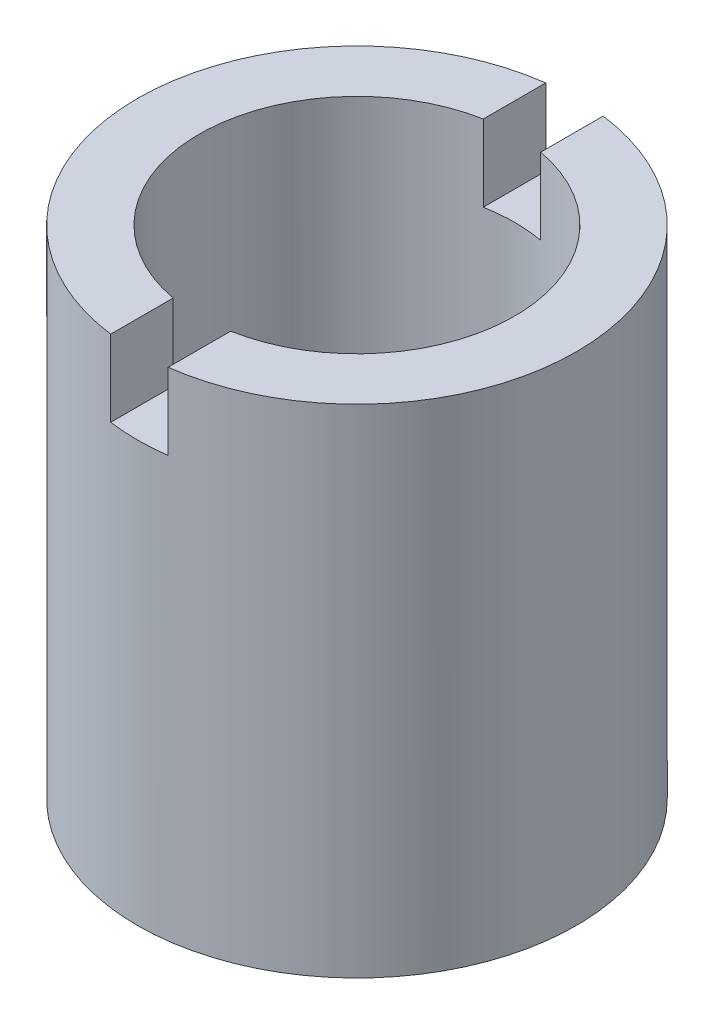
ISO-10303-21;
HEADER;
FILE_DESCRIPTION(('STEP AP214'),'2;1');
FILE_NAME('part.step','',(''),(''),'','','');
FILE_SCHEMA(('AUTOMOTIVE_DESIGN { 1 0 10303 214 1 1 1 1 }'));
ENDSEC;
DATA;
#1=APPLICATION_CONTEXT('core data for automotive mechanical design processes');
#2=APPLICATION_PROTOCOL_DEFINITION('international standard','automotive_design',2000,#1);
#3=PRODUCT_CONTEXT('',#1,'mechanical');
#4=PRODUCT('Part','Part','',(#3));
#5=PRODUCT_RELATED_PRODUCT_CATEGORY('part','',(#4));
#6=PRODUCT_DEFINITION_FORMATION('','',#4);
#7=PRODUCT_DEFINITION_CONTEXT('part definition',#1,'design');
#8=PRODUCT_DEFINITION('design','',#6,#7);
#9=PRODUCT_DEFINITION_SHAPE('','',#8);
#10=(LENGTH_UNIT() NAMED_UNIT(*) SI_UNIT(.MILLI.,.METRE.));
#11=(NAMED_UNIT(*) PLANE_ANGLE_UNIT() SI_UNIT($,.RADIAN.));
#12=(NAMED_UNIT(*) SI_UNIT($,.STERADIAN.) SOLID_ANGLE_UNIT());
#13=UNCERTAINTY_MEASURE_WITH_UNIT(LENGTH_MEASURE(1.E-05),#10,'distance_accuracy_value','');
#14=(GEOMETRIC_REPRESENTATION_CONTEXT(3) GLOBAL_UNCERTAINTY_ASSIGNED_CONTEXT((#13)) GLOBAL_UNIT_ASSIGNED_CONTEXT((#10,
#11,#12)) REPRESENTATION_CONTEXT('',''));
#15=CARTESIAN_POINT('',(0.,0.,0.));
#16=DIRECTION('',(0.,0.,1.));
#17=DIRECTION('',(1.,0.,0.));
#18=AXIS2_PLACEMENT_3D('',#15,#16,#17);
#19=CARTESIAN_POINT('',(0.,20.6502,0.));
#20=DIRECTION('',(0.,1.,0.));
#21=DIRECTION('',(0.,0.,1.));
#22=AXIS2_PLACEMENT_3D('',#19,#20,#21);
#23=PLANE('',#22);
#24=DIRECTION('',(0.,0.,-1.));
#25=VECTOR('',#24,1.);
#26=CARTESIAN_POINT('',(1.1938,20.6502,0.));
#27=LINE('',#26,#25);
#28=CARTESIAN_POINT('',(1.1938,20.6502,-6.44354497151995));
#29=VERTEX_POINT('',#28);
#30=CARTESIAN_POINT('',(1.1938,20.6502,-9.04011656562016));
#31=VERTEX_POINT('',#30);
#32=EDGE_CURVE('E43',#29,#31,#27,.T.);
#33=ORIENTED_EDGE('',*,*,#32,.F.);
#34=CARTESIAN_POINT('',(0.,20.6502,0.));
#35=DIRECTION('',(0.,1.,0.));
#36=DIRECTION('',(0.,0.,1.));
#37=AXIS2_PLACEMENT_3D('',#34,#35,#36);
#38=CIRCLE('',#37,6.5532);
#39=CARTESIAN_POINT('',(1.1938,20.6502,6.44354497151995));
#40=VERTEX_POINT('',#39);
#41=EDGE_CURVE('E112',#40,#29,#38,.T.);
#42=ORIENTED_EDGE('',*,*,#41,.F.);
#43=DIRECTION('',(0.,0.,-1.));
#44=VECTOR('',#43,1.);
#45=CARTESIAN_POINT('',(1.1938,20.6502,0.));
#46=LINE('',#45,#44);
#47=CARTESIAN_POINT('',(1.1938,20.6502,9.04011656562016));
#48=VERTEX_POINT('',#47);
#49=EDGE_CURVE('E111',#48,#40,#46,.T.);
#50=ORIENTED_EDGE('',*,*,#49,.F.);
#51=CARTESIAN_POINT('',(0.,20.6502,0.));
#52=DIRECTION('',(0.,1.,0.));
#53=DIRECTION('',(0.,0.,1.));
#54=AXIS2_PLACEMENT_3D('',#51,#52,#53);
#55=CIRCLE('',#54,9.1186);
#56=EDGE_CURVE('E11',#48,#31,#55,.T.);
#57=ORIENTED_EDGE('',*,*,#56,.T.);
#58=EDGE_LOOP('',(#33,#42,#50,#57));
#59=FACE_BOUND('',#58,.T.);
#60=ADVANCED_FACE('F39',(#59),#23,.T.);
#61=DIRECTION('',(0.,0.,1.));
#62=VECTOR('',#61,1.);
#63=CARTESIAN_POINT('',(-1.1938,20.6502,0.));
#64=LINE('',#63,#62);
#65=CARTESIAN_POINT('',(-1.1938,20.6502,-9.04011656562016));
#66=VERTEX_POINT('',#65);
#67=CARTESIAN_POINT('',(-1.1938,20.6502,-6.44354497151995));
#68=VERTEX_POINT('',#67);
#69=EDGE_CURVE('E100',#66,#68,#64,.T.);
#70=ORIENTED_EDGE('',*,*,#69,.F.);
#71=CARTESIAN_POINT('',(-1.19379999999999,20.6502,9.04011656562016));
#72=VERTEX_POINT('',#71);
#73=EDGE_CURVE('E49',#66,#72,#55,.T.);
#74=ORIENTED_EDGE('',*,*,#73,.T.);
#75=DIRECTION('',(0.,0.,1.));
#76=VECTOR('',#75,1.);
#77=CARTESIAN_POINT('',(-1.1938,20.6502,0.));
#78=LINE('',#77,#76);
#79=CARTESIAN_POINT('',(-1.19379999999999,20.6502,6.44354497151995));
#80=VERTEX_POINT('',#79);
#81=EDGE_CURVE('E116',#80,#72,#78,.T.);
#82=ORIENTED_EDGE('',*,*,#81,.F.);
#83=EDGE_CURVE('E141',#68,#80,#38,.T.);
#84=ORIENTED_EDGE('',*,*,#83,.F.);
#85=EDGE_LOOP('',(#70,#74,#82,#84));
#86=FACE_BOUND('',#85,.T.);
#87=ADVANCED_FACE('F145',(#86),#23,.T.);
#88=CARTESIAN_POINT('',(0.,0.,0.));
#89=DIRECTION('',(0.,1.,0.));
#90=DIRECTION('',(0.,0.,1.));
#91=AXIS2_PLACEMENT_3D('',#88,#89,#90);
#92=PLANE('',#91);
#93=CARTESIAN_POINT('',(0.,0.,0.));
#94=DIRECTION('',(0.,1.,0.));
#95=DIRECTION('',(0.,0.,1.));
#96=AXIS2_PLACEMENT_3D('',#93,#94,#95);
#97=CIRCLE('',#96,9.1186);
#98=CARTESIAN_POINT('',(0.,0.,9.1186));
#99=VERTEX_POINT('',#98);
#100=EDGE_CURVE('E124',#99,#99,#97,.T.);
#101=ORIENTED_EDGE('',*,*,#100,.F.);
#102=EDGE_LOOP('',(#101));
#103=FACE_BOUND('',#102,.T.);
#104=CARTESIAN_POINT('',(0.,0.,0.));
#105=DIRECTION('',(0.,1.,0.));
#106=DIRECTION('',(0.,0.,1.));
#107=AXIS2_PLACEMENT_3D('',#104,#105,#106);
#108=CIRCLE('',#107,6.5532);
#109=CARTESIAN_POINT('',(0.,0.,6.5532));
#110=VERTEX_POINT('',#109);
#111=EDGE_CURVE('E99',#110,#110,#108,.T.);
#112=ORIENTED_EDGE('',*,*,#111,.T.);
#113=EDGE_LOOP('',(#112));
#114=FACE_BOUND('',#113,.T.);
#115=ADVANCED_FACE('F153',(#103,#114),#92,.F.);
#116=CARTESIAN_POINT('',(0.,20.6502,0.));
#117=DIRECTION('',(0.,-1.,0.));
#118=DIRECTION('',(0.,0.,-1.));
#119=AXIS2_PLACEMENT_3D('',#116,#117,#118);
#120=CYLINDRICAL_SURFACE('',#119,9.1186);
#121=CARTESIAN_POINT('',(0.,17.4752,0.));
#122=DIRECTION('',(0.,1.,0.));
#123=DIRECTION('',(0.,0.,1.));
#124=AXIS2_PLACEMENT_3D('',#121,#122,#123);
#125=CIRCLE('',#124,9.1186);
#126=CARTESIAN_POINT('',(1.1938,17.4752,-9.04011656562016));
#127=VERTEX_POINT('',#126);
#128=CARTESIAN_POINT('',(-1.1938,17.4752,-9.04011656562016));
#129=VERTEX_POINT('',#128);
#130=EDGE_CURVE('E107',#127,#129,#125,.T.);
#131=ORIENTED_EDGE('',*,*,#130,.F.);
#132=DIRECTION('',(0.,1.,0.));
#133=VECTOR('',#132,1.);
#134=CARTESIAN_POINT('',(1.1938,17.4752,-9.04011656562016));
#135=LINE('',#134,#133);
#136=EDGE_CURVE('E94',#127,#31,#135,.T.);
#137=ORIENTED_EDGE('',*,*,#136,.T.);
#138=ORIENTED_EDGE('',*,*,#56,.F.);
#139=DIRECTION('',(0.,1.,0.));
#140=VECTOR('',#139,1.);
#141=CARTESIAN_POINT('',(1.1938,17.4752,9.04011656562016));
#142=LINE('',#141,#140);
#143=CARTESIAN_POINT('',(1.1938,17.4752,9.04011656562016));
#144=VERTEX_POINT('',#143);
#145=EDGE_CURVE('E266',#144,#48,#142,.T.);
#146=ORIENTED_EDGE('',*,*,#145,.F.);
#147=CARTESIAN_POINT('',(0.,17.4752,0.));
#148=DIRECTION('',(0.,1.,0.));
#149=DIRECTION('',(0.,0.,1.));
#150=AXIS2_PLACEMENT_3D('',#147,#148,#149);
#151=CIRCLE('',#150,9.1186);
#152=CARTESIAN_POINT('',(-1.19379999999999,17.4752,9.04011656562016));
#153=VERTEX_POINT('',#152);
#154=EDGE_CURVE('E108',#153,#144,#151,.T.);
#155=ORIENTED_EDGE('',*,*,#154,.F.);
#156=DIRECTION('',(0.,1.,0.));
#157=VECTOR('',#156,1.);
#158=CARTESIAN_POINT('',(-1.19379999999999,17.4752,9.04011656562016));
#159=LINE('',#158,#157);
#160=EDGE_CURVE('E117',#153,#72,#159,.T.);
#161=ORIENTED_EDGE('',*,*,#160,.T.);
#162=ORIENTED_EDGE('',*,*,#73,.F.);
#163=DIRECTION('',(0.,1.,0.));
#164=VECTOR('',#163,1.);
#165=CARTESIAN_POINT('',(-1.1938,17.4752,-9.04011656562016));
#166=LINE('',#165,#164);
#167=EDGE_CURVE('E131',#129,#66,#166,.T.);
#168=ORIENTED_EDGE('',*,*,#167,.F.);
#169=EDGE_LOOP('',(#131,#137,#138,#146,#155,#161,#162,#168));
#170=FACE_BOUND('',#169,.T.);
#171=ORIENTED_EDGE('',*,*,#100,.T.);
#172=EDGE_LOOP('',(#171));
#173=FACE_BOUND('',#172,.T.);
#174=ADVANCED_FACE('F41',(#170,#173),#120,.T.);
#175=CARTESIAN_POINT('',(0.,20.6502,0.));
#176=DIRECTION('',(0.,-1.,0.));
#177=DIRECTION('',(0.,0.,-1.));
#178=AXIS2_PLACEMENT_3D('',#175,#176,#177);
#179=CYLINDRICAL_SURFACE('',#178,6.5532);
#180=DIRECTION('',(0.,1.,0.));
#181=VECTOR('',#180,1.);
#182=CARTESIAN_POINT('',(1.1938,17.4752,-6.44354497151995));
#183=LINE('',#182,#181);
#184=CARTESIAN_POINT('',(1.1938,17.4752,-6.44354497151995));
#185=VERTEX_POINT('',#184);
#186=EDGE_CURVE('E88',#185,#29,#183,.T.);
#187=ORIENTED_EDGE('',*,*,#186,.F.);
#188=CARTESIAN_POINT('',(0.,17.4752,0.));
#189=DIRECTION('',(0.,1.,0.));
#190=DIRECTION('',(0.,0.,1.));
#191=AXIS2_PLACEMENT_3D('',#188,#189,#190);
#192=CIRCLE('',#191,6.5532);
#193=CARTESIAN_POINT('',(-1.1938,17.4752,-6.44354497151995));
#194=VERTEX_POINT('',#193);
#195=EDGE_CURVE('E142',#194,#185,#192,.F.);
#196=ORIENTED_EDGE('',*,*,#195,.F.);
#197=DIRECTION('',(0.,1.,0.));
#198=VECTOR('',#197,1.);
#199=CARTESIAN_POINT('',(-1.1938,17.4752,-6.44354497151995));
#200=LINE('',#199,#198);
#201=EDGE_CURVE('E129',#194,#68,#200,.T.);
#202=ORIENTED_EDGE('',*,*,#201,.T.);
#203=ORIENTED_EDGE('',*,*,#83,.T.);
#204=DIRECTION('',(0.,1.,0.));
#205=VECTOR('',#204,1.);
#206=CARTESIAN_POINT('',(-1.19379999999999,17.4752,6.44354497151995));
#207=LINE('',#206,#205);
#208=CARTESIAN_POINT('',(-1.19379999999999,17.4752,6.44354497151995));
#209=VERTEX_POINT('',#208);
#210=EDGE_CURVE('E121',#209,#80,#207,.T.);
#211=ORIENTED_EDGE('',*,*,#210,.F.);
#212=CARTESIAN_POINT('',(0.,17.4752,0.));
#213=DIRECTION('',(0.,1.,0.));
#214=DIRECTION('',(0.,0.,1.));
#215=AXIS2_PLACEMENT_3D('',#212,#213,#214);
#216=CIRCLE('',#215,6.5532);
#217=CARTESIAN_POINT('',(1.1938,17.4752,6.44354497151995));
#218=VERTEX_POINT('',#217);
#219=EDGE_CURVE('E260',#218,#209,#216,.F.);
#220=ORIENTED_EDGE('',*,*,#219,.F.);
#221=DIRECTION('',(0.,1.,0.));
#222=VECTOR('',#221,1.);
#223=CARTESIAN_POINT('',(1.1938,17.4752,6.44354497151995));
#224=LINE('',#223,#222);
#225=EDGE_CURVE('E268',#218,#40,#224,.T.);
#226=ORIENTED_EDGE('',*,*,#225,.T.);
#227=ORIENTED_EDGE('',*,*,#41,.T.);
#228=EDGE_LOOP('',(#187,#196,#202,#203,#211,#220,#226,#227));
#229=FACE_BOUND('',#228,.T.);
#230=ORIENTED_EDGE('',*,*,#111,.F.);
#231=EDGE_LOOP('',(#230));
#232=FACE_BOUND('',#231,.T.);
#233=ADVANCED_FACE('F138',(#229,#232),#179,.F.);
#234=CARTESIAN_POINT('',(-1.1938,17.4752,0.));
#235=DIRECTION('',(-1.,0.,0.));
#236=DIRECTION('',(0.,0.,1.));
#237=AXIS2_PLACEMENT_3D('',#234,#235,#236);
#238=PLANE('',#237);
#239=ORIENTED_EDGE('',*,*,#81,.T.);
#240=ORIENTED_EDGE('',*,*,#160,.F.);
#241=DIRECTION('',(0.,0.,1.));
#242=VECTOR('',#241,1.);
#243=CARTESIAN_POINT('',(-1.1938,17.4752,0.));
#244=LINE('',#243,#242);
#245=EDGE_CURVE('E263',#209,#153,#244,.T.);
#246=ORIENTED_EDGE('',*,*,#245,.F.);
#247=ORIENTED_EDGE('',*,*,#210,.T.);
#248=EDGE_LOOP('',(#239,#240,#246,#247));
#249=FACE_BOUND('',#248,.T.);
#250=ADVANCED_FACE('F158',(#249),#238,.F.);
#251=CARTESIAN_POINT('',(1.1938,17.4752,0.));
#252=DIRECTION('',(1.,0.,0.));
#253=DIRECTION('',(0.,0.,-1.));
#254=AXIS2_PLACEMENT_3D('',#251,#252,#253);
#255=PLANE('',#254);
#256=ORIENTED_EDGE('',*,*,#49,.T.);
#257=ORIENTED_EDGE('',*,*,#225,.F.);
#258=DIRECTION('',(0.,0.,-1.));
#259=VECTOR('',#258,1.);
#260=CARTESIAN_POINT('',(1.1938,17.4752,0.));
#261=LINE('',#260,#259);
#262=EDGE_CURVE('E258',#144,#218,#261,.T.);
#263=ORIENTED_EDGE('',*,*,#262,.F.);
#264=ORIENTED_EDGE('',*,*,#145,.T.);
#265=EDGE_LOOP('',(#256,#257,#263,#264));
#266=FACE_BOUND('',#265,.T.);
#267=ADVANCED_FACE('F164',(#266),#255,.F.);
#268=CARTESIAN_POINT('',(0.,17.4752,0.));
#269=DIRECTION('',(0.,1.,0.));
#270=DIRECTION('',(0.,0.,1.));
#271=AXIS2_PLACEMENT_3D('',#268,#269,#270);
#272=PLANE('',#271);
#273=ORIENTED_EDGE('',*,*,#154,.T.);
#274=ORIENTED_EDGE('',*,*,#262,.T.);
#275=ORIENTED_EDGE('',*,*,#219,.T.);
#276=ORIENTED_EDGE('',*,*,#245,.T.);
#277=EDGE_LOOP('',(#273,#274,#275,#276));
#278=FACE_BOUND('',#277,.T.);
#279=ADVANCED_FACE('F208',(#278),#272,.T.);
#280=CARTESIAN_POINT('',(1.1938,17.4752,0.));
#281=DIRECTION('',(1.,0.,0.));
#282=DIRECTION('',(0.,0.,-1.));
#283=AXIS2_PLACEMENT_3D('',#280,#281,#282);
#284=PLANE('',#283);
#285=ORIENTED_EDGE('',*,*,#32,.T.);
#286=ORIENTED_EDGE('',*,*,#136,.F.);
#287=DIRECTION('',(0.,0.,-1.));
#288=VECTOR('',#287,1.);
#289=CARTESIAN_POINT('',(1.1938,17.4752,0.));
#290=LINE('',#289,#288);
#291=EDGE_CURVE('E248',#185,#127,#290,.T.);
#292=ORIENTED_EDGE('',*,*,#291,.F.);
#293=ORIENTED_EDGE('',*,*,#186,.T.);
#294=EDGE_LOOP('',(#285,#286,#292,#293));
#295=FACE_BOUND('',#294,.T.);
#296=ADVANCED_FACE('F92',(#295),#284,.F.);
#297=CARTESIAN_POINT('',(-1.1938,17.4752,0.));
#298=DIRECTION('',(-1.,0.,0.));
#299=DIRECTION('',(0.,0.,1.));
#300=AXIS2_PLACEMENT_3D('',#297,#298,#299);
#301=PLANE('',#300);
#302=ORIENTED_EDGE('',*,*,#69,.T.);
#303=ORIENTED_EDGE('',*,*,#201,.F.);
#304=DIRECTION('',(0.,0.,1.));
#305=VECTOR('',#304,1.);
#306=CARTESIAN_POINT('',(-1.1938,17.4752,0.));
#307=LINE('',#306,#305);
#308=EDGE_CURVE('E58',#129,#194,#307,.T.);
#309=ORIENTED_EDGE('',*,*,#308,.F.);
#310=ORIENTED_EDGE('',*,*,#167,.T.);
#311=EDGE_LOOP('',(#302,#303,#309,#310));
#312=FACE_BOUND('',#311,.T.);
#313=ADVANCED_FACE('F128',(#312),#301,.F.);
#314=CARTESIAN_POINT('',(0.,17.4752,0.));
#315=DIRECTION('',(0.,1.,0.));
#316=DIRECTION('',(0.,0.,1.));
#317=AXIS2_PLACEMENT_3D('',#314,#315,#316);
#318=PLANE('',#317);
#319=ORIENTED_EDGE('',*,*,#130,.T.);
#320=ORIENTED_EDGE('',*,*,#308,.T.);
#321=ORIENTED_EDGE('',*,*,#195,.T.);
#322=ORIENTED_EDGE('',*,*,#291,.T.);
#323=EDGE_LOOP('',(#319,#320,#321,#322));
#324=FACE_BOUND('',#323,.T.);
#325=ADVANCED_FACE('F236',(#324),#318,.T.);
#326=CLOSED_SHELL('',(#60,#87,#115,#174,#233,#250,#267,#279,#296,#313,#325));
#327=MANIFOLD_SOLID_BREP('B2',#326);
#328=ADVANCED_BREP_SHAPE_REPRESENTATION('',(#18,#327),#14);
#329=SHAPE_DEFINITION_REPRESENTATION(#9,#328);
ENDSEC;
END-ISO-10303-21;
